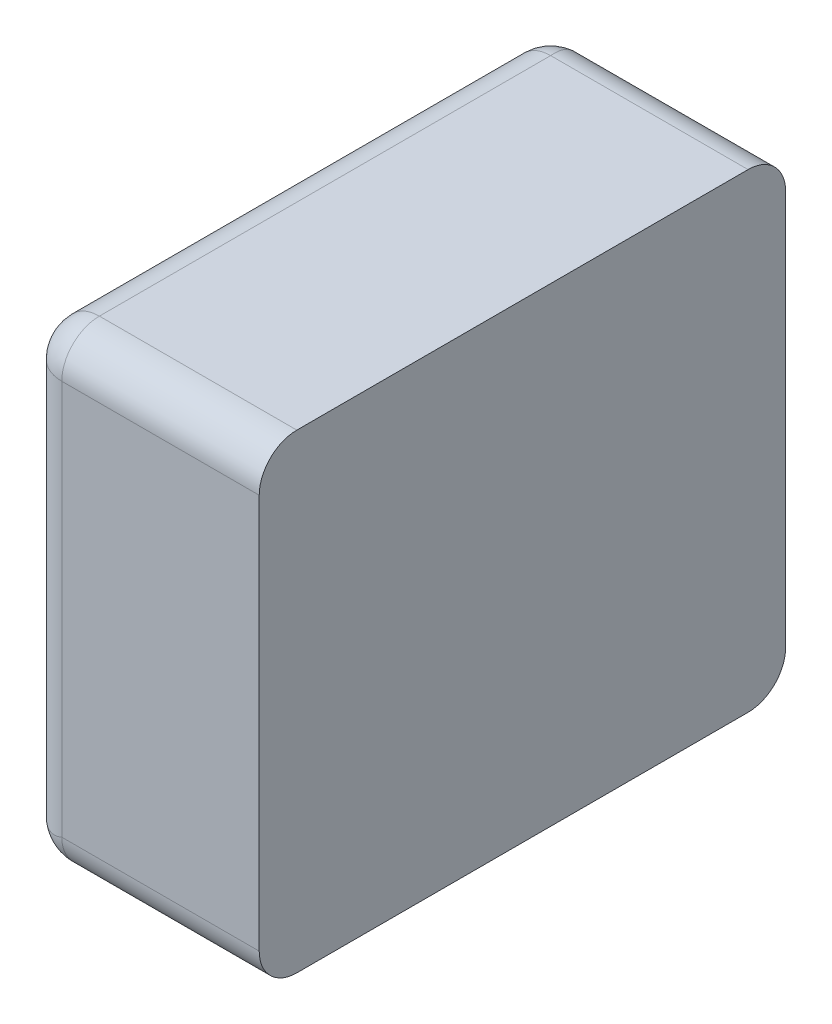
ISO-10303-21;
HEADER;
FILE_DESCRIPTION(('STEP AP214'),'2;1');
FILE_NAME('part.step','',(''),(''),'','','');
FILE_SCHEMA(('AUTOMOTIVE_DESIGN { 1 0 10303 214 1 1 1 1 }'));
ENDSEC;
DATA;
#1=APPLICATION_CONTEXT('core data for automotive mechanical design processes');
#2=APPLICATION_PROTOCOL_DEFINITION('international standard','automotive_design',2000,#1);
#3=PRODUCT_CONTEXT('',#1,'mechanical');
#4=PRODUCT('Part','Part','',(#3));
#5=PRODUCT_RELATED_PRODUCT_CATEGORY('part','',(#4));
#6=PRODUCT_DEFINITION_FORMATION('','',#4);
#7=PRODUCT_DEFINITION_CONTEXT('part definition',#1,'design');
#8=PRODUCT_DEFINITION('design','',#6,#7);
#9=PRODUCT_DEFINITION_SHAPE('','',#8);
#10=(LENGTH_UNIT() NAMED_UNIT(*) SI_UNIT(.MILLI.,.METRE.));
#11=(NAMED_UNIT(*) PLANE_ANGLE_UNIT() SI_UNIT($,.RADIAN.));
#12=(NAMED_UNIT(*) SI_UNIT($,.STERADIAN.) SOLID_ANGLE_UNIT());
#13=UNCERTAINTY_MEASURE_WITH_UNIT(LENGTH_MEASURE(1.E-05),#10,'distance_accuracy_value','');
#14=(GEOMETRIC_REPRESENTATION_CONTEXT(3) GLOBAL_UNCERTAINTY_ASSIGNED_CONTEXT((#13)) GLOBAL_UNIT_ASSIGNED_CONTEXT((#10,
#11,#12)) REPRESENTATION_CONTEXT('',''));
#15=CARTESIAN_POINT('',(0.,0.,0.));
#16=DIRECTION('',(0.,0.,1.));
#17=DIRECTION('',(1.,0.,0.));
#18=AXIS2_PLACEMENT_3D('',#15,#16,#17);
#19=CARTESIAN_POINT('',(-0.46,-0.21,0.04));
#20=DIRECTION('',(0.408248290463863,0.408248290463863,-0.816496580927726));
#21=DIRECTION('',(-0.577350269189626,-0.577350269189626,-0.577350269189626));
#22=AXIS2_PLACEMENT_3D('',#19,#20,#21);
#23=SPHERICAL_SURFACE('',#22,0.04);
#24=CARTESIAN_POINT('',(-0.46,-0.21,0.04));
#25=DIRECTION('',(0.,0.,-1.));
#26=DIRECTION('',(-1.,0.,0.));
#27=AXIS2_PLACEMENT_3D('',#24,#25,#26);
#28=CIRCLE('',#27,0.04);
#29=CARTESIAN_POINT('',(-0.46,-0.25,0.04));
#30=VERTEX_POINT('',#29);
#31=CARTESIAN_POINT('',(-0.5,-0.21,0.04));
#32=VERTEX_POINT('',#31);
#33=EDGE_CURVE('E11',#30,#32,#28,.T.);
#34=ORIENTED_EDGE('',*,*,#33,.T.);
#35=CARTESIAN_POINT('',(-0.46,-0.21,0.04));
#36=DIRECTION('',(0.,-1.,0.));
#37=DIRECTION('',(0.,0.,-1.));
#38=AXIS2_PLACEMENT_3D('',#35,#36,#37);
#39=CIRCLE('',#38,0.04);
#40=CARTESIAN_POINT('',(-0.46,-0.21,0.));
#41=VERTEX_POINT('',#40);
#42=EDGE_CURVE('E25',#32,#41,#39,.T.);
#43=ORIENTED_EDGE('',*,*,#42,.T.);
#44=CARTESIAN_POINT('',(-0.46,-0.21,0.));
#45=CARTESIAN_POINT('',(-0.460127557385056,-0.210278560754346,-1.18072138294032E-09));
#46=CARTESIAN_POINT('',(-0.460252147979106,-0.210558476265733,3.51993958575014E-06));
#47=CARTESIAN_POINT('',(-0.460495869427172,-0.211121737223217,1.76243940577201E-05));
#48=CARTESIAN_POINT('',(-0.460614978217461,-0.211405091561275,2.82339832723442E-05));
#49=CARTESIAN_POINT('',(-0.460847694547059,-0.211974934925471,5.6585914872202E-05));
#50=CARTESIAN_POINT('',(-0.460961279831825,-0.212261431714088,7.43548005994813E-05));
#51=CARTESIAN_POINT('',(-0.461182918810225,-0.2128372634657,0.000117088509181837));
#52=CARTESIAN_POINT('',(-0.461290950148552,-0.213126605044557,0.000142080083021138));
#53=CARTESIAN_POINT('',(-0.461501458734764,-0.213707827313347,0.00019931719054796));
#54=CARTESIAN_POINT('',(-0.461603913603208,-0.213999713457951,0.000231589611122887));
#55=CARTESIAN_POINT('',(-0.461803255191422,-0.214585722737492,0.000303440197509092));
#56=CARTESIAN_POINT('',(-0.461900119585062,-0.214879850156528,0.000343045311385643));
#57=CARTESIAN_POINT('',(-0.462088275552899,-0.215470042193562,0.000429608185776674));
#58=CARTESIAN_POINT('',(-0.462179544933358,-0.215766109942693,0.000476592887279755));
#59=CARTESIAN_POINT('',(-0.462356511105422,-0.216359866083455,0.000577951876045367));
#60=CARTESIAN_POINT('',(-0.462442185895687,-0.216657556406001,0.000632353011704264));
#61=CARTESIAN_POINT('',(-0.462691323865077,-0.217554249833819,0.00080701684119811));
#62=CARTESIAN_POINT('',(-0.462845874981088,-0.218153648342018,0.000938267444546423));
#63=CARTESIAN_POINT('',(-0.463132999169867,-0.219355247629956,0.00123055854383293));
#64=CARTESIAN_POINT('',(-0.463265404318734,-0.219957437108347,0.00139180864660248));
#65=CARTESIAN_POINT('',(-0.463508574015279,-0.221162228110556,0.00174420122467979));
#66=CARTESIAN_POINT('',(-0.463619178639514,-0.221764802341561,0.00193554733844657));
#67=CARTESIAN_POINT('',(-0.463819193285901,-0.22296791621749,0.00234811839129835));
#68=CARTESIAN_POINT('',(-0.46390845289006,-0.223568413630763,0.0025695390760552));
#69=CARTESIAN_POINT('',(-0.464066354376574,-0.224764966470295,0.00304214168525152));
#70=CARTESIAN_POINT('',(-0.464134856746394,-0.225360966678358,0.00329350983136255));
#71=CARTESIAN_POINT('',(-0.464251940785221,-0.22654614471619,0.00382578019481727));
#72=CARTESIAN_POINT('',(-0.464300394897465,-0.227135256366021,0.00410685765918635));
#73=CARTESIAN_POINT('',(-0.464378196984959,-0.228304320731066,0.00469820970399706));
#74=CARTESIAN_POINT('',(-0.46440743011501,-0.228884198547395,0.00500864733151548));
#75=CARTESIAN_POINT('',(-0.464447716751283,-0.230032511248382,0.00565827192058936));
#76=CARTESIAN_POINT('',(-0.464458668570609,-0.230600864869804,0.00599760872761896));
#77=CARTESIAN_POINT('',(-0.464463425502259,-0.231723908356188,0.00670447287731431));
#78=CARTESIAN_POINT('',(-0.464457142234807,-0.232278513023084,0.00707213609172891));
#79=CARTESIAN_POINT('',(-0.4644285620246,-0.233371910678868,0.00783498345682941));
#80=CARTESIAN_POINT('',(-0.464406189870943,-0.233910616989062,0.00823028896307658));
#81=CARTESIAN_POINT('',(-0.464346658254607,-0.234970152446474,0.00904764125945902));
#82=CARTESIAN_POINT('',(-0.464309436340763,-0.235490895871217,0.00946979457457917));
#83=CARTESIAN_POINT('',(-0.464221517607221,-0.236512531597073,0.0103399540326488));
#84=CARTESIAN_POINT('',(-0.464170770435167,-0.237013341512198,0.010788051779879));
#85=CARTESIAN_POINT('',(-0.46405719186342,-0.237993236431504,0.0117091046013599));
#86=CARTESIAN_POINT('',(-0.463994321319257,-0.238472244674781,0.0121821364878388));
#87=CARTESIAN_POINT('',(-0.463857956766166,-0.239406770787941,0.013151957304817));
#88=CARTESIAN_POINT('',(-0.463784433723583,-0.239862219687463,0.013648808595971));
#89=CARTESIAN_POINT('',(-0.463628286445982,-0.240747977592035,0.0146650659177713));
#90=CARTESIAN_POINT('',(-0.46354564201038,-0.241178227431671,0.0151845204015858));
#91=CARTESIAN_POINT('',(-0.463372826812942,-0.242012060678785,0.0162446830324919));
#92=CARTESIAN_POINT('',(-0.463282643251913,-0.242415596564543,0.0167854264635976));
#93=CARTESIAN_POINT('',(-0.463096368054564,-0.243194604782275,0.0178867708690628));
#94=CARTESIAN_POINT('',(-0.463000269462519,-0.243570042877811,0.0184473948804289));
#95=CARTESIAN_POINT('',(-0.462803816384422,-0.244291593601069,0.0195870134748399));
#96=CARTESIAN_POINT('',(-0.462703459130377,-0.244637686703484,0.0201660199423669));
#97=CARTESIAN_POINT('',(-0.46250016518995,-0.245299425855903,0.0213408302671167));
#98=CARTESIAN_POINT('',(-0.462397228198719,-0.245615068285972,0.0219366361105733));
#99=CARTESIAN_POINT('',(-0.462190465730978,-0.24621492926737,0.0231433908657014));
#100=CARTESIAN_POINT('',(-0.462086640648683,-0.246499161053504,0.0237543332657589));
#101=CARTESIAN_POINT('',(-0.461879797543165,-0.247035372388784,0.0249896311582642));
#102=CARTESIAN_POINT('',(-0.46177677883926,-0.247287382721173,0.02561397317289));
#103=CARTESIAN_POINT('',(-0.46157323870074,-0.247758474251228,0.0268742705254565));
#104=CARTESIAN_POINT('',(-0.46147271375646,-0.247977604210201,0.0275102070660422));
#105=CARTESIAN_POINT('',(-0.461275836098283,-0.248382411747495,0.0287918301830908));
#106=CARTESIAN_POINT('',(-0.461179475341301,-0.248568156224819,0.029437494386606));
#107=CARTESIAN_POINT('',(-0.460992575894087,-0.248905824846854,0.0307366524585404));
#108=CARTESIAN_POINT('',(-0.46090202300229,-0.249057833913879,0.0313901222006782));
#109=CARTESIAN_POINT('',(-0.4607283543202,-0.249327819170727,0.0327029213142236));
#110=CARTESIAN_POINT('',(-0.460645216653365,-0.249445897918684,0.0333622266837099));
#111=CARTESIAN_POINT('',(-0.460487948826669,-0.249647967602046,0.0346846825640378));
#112=CARTESIAN_POINT('',(-0.460413787737315,-0.249732078063409,0.0353478111151387));
#113=CARTESIAN_POINT('',(-0.460275990401151,-0.249866304694446,0.0366758691427694));
#114=CARTESIAN_POINT('',(-0.460212312956498,-0.24991655645203,0.0373407806009987));
#115=CARTESIAN_POINT('',(-0.460096934649245,-0.249983337054039,0.0386703111001373));
#116=CARTESIAN_POINT('',(-0.460045181312705,-0.250000016251174,0.0393349180578663));
#117=CARTESIAN_POINT('',(-0.46,-0.25,0.04));
#118=B_SPLINE_CURVE_WITH_KNOTS('',3,(#44,#45,#46,#47,#48,#49,#50,#51,#52,#53,#54,#55,#56,#57,
#58,#59,#60,#61,#62,#63,#64,#65,#66,#67,#68,#69,#70,#71,#72,#73,#74,#75,#76,#77,#78,#79,#80,#81,
#82,#83,#84,#85,#86,#87,#88,#89,#90,#91,#92,#93,#94,#95,#96,#97,#98,#99,#100,#101,#102,#103,
#104,#105,#106,#107,#108,#109,#110,#111,#112,#113,#114,#115,#116,#117),.UNSPECIFIED.,.F.,.F.,(4,
2,2,2,2,2,2,2,2,2,2,2,2,2,2,2,2,2,2,2,2,2,2,2,2,2,2,2,2,2,2,2,2,2,2,2,4),(0.,
0.000919089022198575,0.00184160128014346,0.00276756572820716,0.0036970046531216,
0.00462993370669373,0.00556636195101822,0.00650629191553111,0.00744971966525181,
0.0093468156756545,0.0112577016204073,0.0131821224064945,0.0151197292985631,0.0170700841596432,
0.0190326640796589,0.0210068663346625,0.0229920136260436,0.0249873595550524,0.0269920942936929,
0.0290053504183038,0.0310262088768823,0.0330537050654175,0.0350868349921645,0.0371245615119336,
0.0391658206151052,0.0412095277582366,0.0432545842248347,0.0452998835061398,0.0473443176926332,
0.0493867838674516,0.0514261904929764,0.0534614637815629,0.0554915540406866,0.0575154419816866,
0.0595321449797765,0.0615407232710351,0.063540286069666),.UNSPECIFIED.);
#119=EDGE_CURVE('E108',#41,#30,#118,.T.);
#120=ORIENTED_EDGE('',*,*,#119,.T.);
#121=EDGE_LOOP('',(#34,#43,#120));
#122=FACE_BOUND('',#121,.T.);
#123=ADVANCED_FACE('F17',(#122),#23,.T.);
#124=CARTESIAN_POINT('',(-0.46,0.21,0.04));
#125=DIRECTION('',(0.408248290463863,-0.408248290463862,-0.816496580927727));
#126=DIRECTION('',(-0.577350269189628,0.577350269189625,-0.577350269189625));
#127=AXIS2_PLACEMENT_3D('',#124,#125,#126);
#128=SPHERICAL_SURFACE('',#127,0.04);
#129=CARTESIAN_POINT('',(-0.46,0.21,0.04));
#130=DIRECTION('',(0.,0.,-1.));
#131=DIRECTION('',(0.,1.,0.));
#132=AXIS2_PLACEMENT_3D('',#129,#130,#131);
#133=CIRCLE('',#132,0.04);
#134=CARTESIAN_POINT('',(-0.5,0.21,0.04));
#135=VERTEX_POINT('',#134);
#136=CARTESIAN_POINT('',(-0.46,0.25,0.04));
#137=VERTEX_POINT('',#136);
#138=EDGE_CURVE('E295',#135,#137,#133,.T.);
#139=ORIENTED_EDGE('',*,*,#138,.T.);
#140=CARTESIAN_POINT('',(-0.46,0.25,0.04));
#141=CARTESIAN_POINT('',(-0.460045181312705,0.250000016251174,0.0393349180578663));
#142=CARTESIAN_POINT('',(-0.460096934649245,0.249983337054039,0.0386703111001374));
#143=CARTESIAN_POINT('',(-0.460212312956498,0.24991655645203,0.0373407806009987));
#144=CARTESIAN_POINT('',(-0.460275990401151,0.249866304694446,0.0366758691427694));
#145=CARTESIAN_POINT('',(-0.460413787737315,0.249732078063409,0.0353478111151388));
#146=CARTESIAN_POINT('',(-0.460487948826669,0.249647967602046,0.0346846825640378));
#147=CARTESIAN_POINT('',(-0.460645216653365,0.249445897918684,0.03336222668371));
#148=CARTESIAN_POINT('',(-0.4607283543202,0.249327819170727,0.0327029213142236));
#149=CARTESIAN_POINT('',(-0.46090202300229,0.249057833913879,0.0313901222006782));
#150=CARTESIAN_POINT('',(-0.460992575894087,0.248905824846854,0.0307366524585404));
#151=CARTESIAN_POINT('',(-0.461179475341301,0.248568156224819,0.029437494386606));
#152=CARTESIAN_POINT('',(-0.461275836098283,0.248382411747495,0.0287918301830908));
#153=CARTESIAN_POINT('',(-0.46147271375646,0.247977604210201,0.0275102070660422));
#154=CARTESIAN_POINT('',(-0.46157323870074,0.247758474251228,0.0268742705254564));
#155=CARTESIAN_POINT('',(-0.46177677883926,0.247287382721173,0.0256139731728899));
#156=CARTESIAN_POINT('',(-0.461879797543165,0.247035372388784,0.0249896311582642));
#157=CARTESIAN_POINT('',(-0.462086640648683,0.246499161053504,0.0237543332657589));
#158=CARTESIAN_POINT('',(-0.462190465730978,0.24621492926737,0.0231433908657014));
#159=CARTESIAN_POINT('',(-0.462397228198719,0.245615068285972,0.0219366361105733));
#160=CARTESIAN_POINT('',(-0.46250016518995,0.245299425855903,0.0213408302671167));
#161=CARTESIAN_POINT('',(-0.462703459130378,0.244637686703484,0.020166019942367));
#162=CARTESIAN_POINT('',(-0.462803816384422,0.244291593601069,0.0195870134748399));
#163=CARTESIAN_POINT('',(-0.463000269462519,0.243570042877811,0.0184473948804289));
#164=CARTESIAN_POINT('',(-0.463096368054564,0.243194604782275,0.0178867708690628));
#165=CARTESIAN_POINT('',(-0.463282643251913,0.242415596564543,0.0167854264635976));
#166=CARTESIAN_POINT('',(-0.463372826812942,0.242012060678785,0.0162446830324919));
#167=CARTESIAN_POINT('',(-0.46354564201038,0.241178227431671,0.0151845204015858));
#168=CARTESIAN_POINT('',(-0.463628286445982,0.240747977592035,0.0146650659177713));
#169=CARTESIAN_POINT('',(-0.463784433723584,0.239862219687463,0.013648808595971));
#170=CARTESIAN_POINT('',(-0.463857956766166,0.239406770787941,0.013151957304817));
#171=CARTESIAN_POINT('',(-0.463994321319257,0.238472244674781,0.0121821364878388));
#172=CARTESIAN_POINT('',(-0.46405719186342,0.237993236431504,0.0117091046013598));
#173=CARTESIAN_POINT('',(-0.464170770435167,0.237013341512198,0.010788051779879));
#174=CARTESIAN_POINT('',(-0.464221517607221,0.236512531597073,0.0103399540326488));
#175=CARTESIAN_POINT('',(-0.464309436340763,0.235490895871217,0.00946979457457914));
#176=CARTESIAN_POINT('',(-0.464346658254607,0.234970152446474,0.009047641259459));
#177=CARTESIAN_POINT('',(-0.464406189870943,0.233910616989061,0.00823028896307656));
#178=CARTESIAN_POINT('',(-0.4644285620246,0.233371910678868,0.0078349834568294));
#179=CARTESIAN_POINT('',(-0.464457142234807,0.232278513023084,0.0070721360917289));
#180=CARTESIAN_POINT('',(-0.464463425502259,0.231723908356188,0.00670447287731431));
#181=CARTESIAN_POINT('',(-0.464458668570609,0.230600864869804,0.00599760872761896));
#182=CARTESIAN_POINT('',(-0.464447716751283,0.230032511248382,0.00565827192058937));
#183=CARTESIAN_POINT('',(-0.46440743011501,0.228884198547395,0.0050086473315155));
#184=CARTESIAN_POINT('',(-0.464378196984959,0.228304320731066,0.00469820970399707));
#185=CARTESIAN_POINT('',(-0.464300394897465,0.227135256366021,0.00410685765918635));
#186=CARTESIAN_POINT('',(-0.464251940785221,0.22654614471619,0.00382578019481727));
#187=CARTESIAN_POINT('',(-0.464134856746394,0.225360966678358,0.00329350983136255));
#188=CARTESIAN_POINT('',(-0.464066354376574,0.224764966470295,0.00304214168525152));
#189=CARTESIAN_POINT('',(-0.46390845289006,0.223568413630763,0.0025695390760552));
#190=CARTESIAN_POINT('',(-0.463819193285901,0.22296791621749,0.00234811839129834));
#191=CARTESIAN_POINT('',(-0.463619178639514,0.221764802341561,0.00193554733844656));
#192=CARTESIAN_POINT('',(-0.463508574015279,0.221162228110556,0.00174420122467977));
#193=CARTESIAN_POINT('',(-0.463265404318734,0.219957437108347,0.00139180864660246));
#194=CARTESIAN_POINT('',(-0.463132999169867,0.219355247629956,0.00123055854383292));
#195=CARTESIAN_POINT('',(-0.462845874981088,0.218153648342018,0.000938267444546416));
#196=CARTESIAN_POINT('',(-0.462691323865077,0.217554249833819,0.000807016841198092));
#197=CARTESIAN_POINT('',(-0.462442185895688,0.216657556406001,0.000632353011704253));
#198=CARTESIAN_POINT('',(-0.462356511105422,0.216359866083455,0.000577951876045363));
#199=CARTESIAN_POINT('',(-0.462179544933358,0.215766109942693,0.00047659288727976));
#200=CARTESIAN_POINT('',(-0.462088275552899,0.215470042193562,0.000429608185776681));
#201=CARTESIAN_POINT('',(-0.461900119585062,0.214879850156529,0.000343045311385648));
#202=CARTESIAN_POINT('',(-0.461803255191423,0.214585722737492,0.000303440197509093));
#203=CARTESIAN_POINT('',(-0.461603913603209,0.213999713457951,0.000231589611122885));
#204=CARTESIAN_POINT('',(-0.461501458734764,0.213707827313347,0.00019931719054796));
#205=CARTESIAN_POINT('',(-0.461290950148552,0.213126605044557,0.000142080083021138));
#206=CARTESIAN_POINT('',(-0.461182918810225,0.2128372634657,0.000117088509181835));
#207=CARTESIAN_POINT('',(-0.460961279831825,0.212261431714088,7.43548005994835E-05));
#208=CARTESIAN_POINT('',(-0.460847694547059,0.211974934925471,5.65859148722095E-05));
#209=CARTESIAN_POINT('',(-0.460614978217461,0.211405091561275,2.82339832723494E-05));
#210=CARTESIAN_POINT('',(-0.460495869427172,0.211121737223217,1.76243940577182E-05));
#211=CARTESIAN_POINT('',(-0.460252147979106,0.210558476265733,3.5199395857389E-06));
#212=CARTESIAN_POINT('',(-0.460127557385056,0.210278560754346,-1.18072139678394E-09));
#213=CARTESIAN_POINT('',(-0.46,0.21,0.));
#214=B_SPLINE_CURVE_WITH_KNOTS('',3,(#140,#141,#142,#143,#144,#145,#146,#147,#148,#149,#150,
#151,#152,#153,#154,#155,#156,#157,#158,#159,#160,#161,#162,#163,#164,#165,#166,#167,#168,#169,
#170,#171,#172,#173,#174,#175,#176,#177,#178,#179,#180,#181,#182,#183,#184,#185,#186,#187,#188,
#189,#190,#191,#192,#193,#194,#195,#196,#197,#198,#199,#200,#201,#202,#203,#204,#205,#206,#207,
#208,#209,#210,#211,#212,#213),.UNSPECIFIED.,.F.,.F.,(4,2,2,2,2,2,2,2,2,2,2,2,2,2,2,2,2,2,2,2,2,
2,2,2,2,2,2,2,2,2,2,2,2,2,2,2,4),(0.,0.00199956279863086,0.0040081410898894,0.00602484408797931,
0.00804873202897934,0.0100788222881031,0.0121140955766896,0.0141535022022144,0.0161959683770328,
0.0182404025635261,0.0202857018448312,0.0223307583114294,0.0243744654545608,0.0264157245577324,
0.0284534510775015,0.0304865810042485,0.0325140771927837,0.0345349356513622,0.0365481917759731,
0.0385529265146136,0.0405482724436223,0.0425334197350035,0.044507621990007,0.0464702019100227,
0.0484205567711029,0.0503581636631715,0.0522825844492588,0.0541934703940115,0.0560905664044142,
0.0570339941541349,0.0579739241186477,0.0589103523629722,0.0598432814165443,0.0607727203414588,
0.0616986847895225,0.0626211970474674,0.063540286069666),.UNSPECIFIED.);
#215=CARTESIAN_POINT('',(-0.46,0.21,0.));
#216=VERTEX_POINT('',#215);
#217=EDGE_CURVE('E264',#137,#216,#214,.T.);
#218=ORIENTED_EDGE('',*,*,#217,.T.);
#219=CARTESIAN_POINT('',(-0.46,0.21,0.04));
#220=DIRECTION('',(0.,1.,0.));
#221=DIRECTION('',(-1.,0.,0.));
#222=AXIS2_PLACEMENT_3D('',#219,#220,#221);
#223=CIRCLE('',#222,0.0400000000000001);
#224=EDGE_CURVE('E259',#216,#135,#223,.T.);
#225=ORIENTED_EDGE('',*,*,#224,.T.);
#226=EDGE_LOOP('',(#139,#218,#225));
#227=FACE_BOUND('',#226,.T.);
#228=ADVANCED_FACE('F278',(#227),#128,.T.);
#229=CARTESIAN_POINT('',(-0.3125,0.21,0.04));
#230=DIRECTION('',(-1.,0.,0.));
#231=DIRECTION('',(0.,0.707106781186548,-0.707106781186547));
#232=AXIS2_PLACEMENT_3D('',#229,#230,#231);
#233=CYLINDRICAL_SURFACE('',#232,0.04);
#234=CARTESIAN_POINT('',(-0.25,0.21,0.04));
#235=DIRECTION('',(-1.,0.,0.));
#236=DIRECTION('',(0.,0.707106781186548,-0.707106781186547));
#237=AXIS2_PLACEMENT_3D('',#234,#235,#236);
#238=CIRCLE('',#237,0.04);
#239=CARTESIAN_POINT('',(-0.25,0.25,0.04));
#240=VERTEX_POINT('',#239);
#241=CARTESIAN_POINT('',(-0.25,0.21,0.));
#242=VERTEX_POINT('',#241);
#243=EDGE_CURVE('E257',#240,#242,#238,.T.);
#244=ORIENTED_EDGE('',*,*,#243,.T.);
#245=DIRECTION('',(-1.,0.,0.));
#246=VECTOR('',#245,1.);
#247=CARTESIAN_POINT('',(-0.3125,0.21,0.));
#248=LINE('',#247,#246);
#249=EDGE_CURVE('E118',#242,#216,#248,.T.);
#250=ORIENTED_EDGE('',*,*,#249,.T.);
#251=ORIENTED_EDGE('',*,*,#217,.F.);
#252=DIRECTION('',(1.,0.,0.));
#253=VECTOR('',#252,1.);
#254=CARTESIAN_POINT('',(-0.3125,0.25,0.04));
#255=LINE('',#254,#253);
#256=EDGE_CURVE('E249',#137,#240,#255,.T.);
#257=ORIENTED_EDGE('',*,*,#256,.T.);
#258=EDGE_LOOP('',(#244,#250,#251,#257));
#259=FACE_BOUND('',#258,.T.);
#260=ADVANCED_FACE('F270',(#259),#233,.T.);
#261=CARTESIAN_POINT('',(-0.46,0.125,0.04));
#262=DIRECTION('',(0.,-1.,0.));
#263=DIRECTION('',(-0.707106781186549,0.,-0.707106781186546));
#264=AXIS2_PLACEMENT_3D('',#261,#262,#263);
#265=CYLINDRICAL_SURFACE('',#264,0.04);
#266=ORIENTED_EDGE('',*,*,#42,.F.);
#267=DIRECTION('',(0.,1.,0.));
#268=VECTOR('',#267,1.);
#269=CARTESIAN_POINT('',(-0.5,0.125,0.04));
#270=LINE('',#269,#268);
#271=EDGE_CURVE('E246',#32,#135,#270,.T.);
#272=ORIENTED_EDGE('',*,*,#271,.T.);
#273=ORIENTED_EDGE('',*,*,#224,.F.);
#274=DIRECTION('',(0.,-1.,0.));
#275=VECTOR('',#274,1.);
#276=CARTESIAN_POINT('',(-0.46,0.125,0.));
#277=LINE('',#276,#275);
#278=EDGE_CURVE('E244',#216,#41,#277,.T.);
#279=ORIENTED_EDGE('',*,*,#278,.T.);
#280=EDGE_LOOP('',(#266,#272,#273,#279));
#281=FACE_BOUND('',#280,.T.);
#282=ADVANCED_FACE('F229',(#281),#265,.T.);
#283=CARTESIAN_POINT('',(-0.46,-0.21,0.52));
#284=DIRECTION('',(-0.408248290463864,-0.408248290463862,-0.816496580927726));
#285=DIRECTION('',(-0.577350269189627,-0.577350269189625,0.577350269189626));
#286=AXIS2_PLACEMENT_3D('',#283,#284,#285);
#287=SPHERICAL_SURFACE('',#286,0.04);
#288=CARTESIAN_POINT('',(-0.46,-0.21,0.56));
#289=CARTESIAN_POINT('',(-0.460278560754346,-0.210127557385056,0.560000001180721));
#290=CARTESIAN_POINT('',(-0.460558476265733,-0.210252147979106,0.559996480060414));
#291=CARTESIAN_POINT('',(-0.461121737223217,-0.210495869427172,0.559982375605942));
#292=CARTESIAN_POINT('',(-0.461405091561275,-0.210614978217461,0.559971766016728));
#293=CARTESIAN_POINT('',(-0.461974934925471,-0.210847694547059,0.559943414085128));
#294=CARTESIAN_POINT('',(-0.462261431714088,-0.210961279831825,0.559925645199401));
#295=CARTESIAN_POINT('',(-0.4628372634657,-0.211182918810225,0.559882911490818));
#296=CARTESIAN_POINT('',(-0.463126605044557,-0.211290950148552,0.559857919916979));
#297=CARTESIAN_POINT('',(-0.463707827313347,-0.211501458734764,0.559800682809452));
#298=CARTESIAN_POINT('',(-0.463999713457951,-0.211603913603208,0.559768410388877));
#299=CARTESIAN_POINT('',(-0.464585722737492,-0.211803255191422,0.559696559802491));
#300=CARTESIAN_POINT('',(-0.464879850156529,-0.211900119585062,0.559656954688614));
#301=CARTESIAN_POINT('',(-0.465470042193562,-0.212088275552899,0.559570391814223));
#302=CARTESIAN_POINT('',(-0.465766109942693,-0.212179544933358,0.55952340711272));
#303=CARTESIAN_POINT('',(-0.466359866083455,-0.212356511105421,0.559422048123955));
#304=CARTESIAN_POINT('',(-0.466657556406001,-0.212442185895687,0.559367646988296));
#305=CARTESIAN_POINT('',(-0.467554249833819,-0.212691323865077,0.559192983158802));
#306=CARTESIAN_POINT('',(-0.468153648342018,-0.212845874981088,0.559061732555454));
#307=CARTESIAN_POINT('',(-0.469355247629956,-0.213132999169867,0.558769441456167));
#308=CARTESIAN_POINT('',(-0.469957437108347,-0.213265404318734,0.558608191353398));
#309=CARTESIAN_POINT('',(-0.471162228110557,-0.213508574015279,0.55825579877532));
#310=CARTESIAN_POINT('',(-0.471764802341561,-0.213619178639514,0.558064452661553));
#311=CARTESIAN_POINT('',(-0.47296791621749,-0.213819193285901,0.557651881608702));
#312=CARTESIAN_POINT('',(-0.473568413630763,-0.21390845289006,0.557430460923945));
#313=CARTESIAN_POINT('',(-0.474764966470295,-0.214066354376574,0.556957858314749));
#314=CARTESIAN_POINT('',(-0.475360966678358,-0.214134856746394,0.556706490168637));
#315=CARTESIAN_POINT('',(-0.47654614471619,-0.21425194078522,0.556174219805183));
#316=CARTESIAN_POINT('',(-0.477135256366021,-0.214300394897465,0.555893142340814));
#317=CARTESIAN_POINT('',(-0.478304320731066,-0.214378196984959,0.555301790296003));
#318=CARTESIAN_POINT('',(-0.478884198547395,-0.21440743011501,0.554991352668485));
#319=CARTESIAN_POINT('',(-0.480032511248382,-0.214447716751283,0.554341728079411));
#320=CARTESIAN_POINT('',(-0.480600864869804,-0.214458668570609,0.554002391272381));
#321=CARTESIAN_POINT('',(-0.481723908356188,-0.214463425502259,0.553295527122686));
#322=CARTESIAN_POINT('',(-0.482278513023084,-0.214457142234807,0.552927863908271));
#323=CARTESIAN_POINT('',(-0.483371910678868,-0.2144285620246,0.552165016543171));
#324=CARTESIAN_POINT('',(-0.483910616989062,-0.214406189870943,0.551769711036924));
#325=CARTESIAN_POINT('',(-0.484970152446475,-0.214346658254607,0.550952358740541));
#326=CARTESIAN_POINT('',(-0.485490895871217,-0.214309436340763,0.550530205425421));
#327=CARTESIAN_POINT('',(-0.486512531597073,-0.214221517607221,0.549660045967351));
#328=CARTESIAN_POINT('',(-0.487013341512198,-0.214170770435167,0.549211948220121));
#329=CARTESIAN_POINT('',(-0.487993236431504,-0.21405719186342,0.54829089539864));
#330=CARTESIAN_POINT('',(-0.488472244674781,-0.213994321319257,0.547817863512161));
#331=CARTESIAN_POINT('',(-0.489406770787941,-0.213857956766166,0.546848042695183));
#332=CARTESIAN_POINT('',(-0.489862219687463,-0.213784433723583,0.546351191404029));
#333=CARTESIAN_POINT('',(-0.490747977592035,-0.213628286445982,0.545334934082229));
#334=CARTESIAN_POINT('',(-0.491178227431671,-0.21354564201038,0.544815479598414));
#335=CARTESIAN_POINT('',(-0.492012060678785,-0.213372826812942,0.543755316967508));
#336=CARTESIAN_POINT('',(-0.492415596564543,-0.213282643251913,0.543214573536402));
#337=CARTESIAN_POINT('',(-0.493194604782275,-0.213096368054564,0.542113229130937));
#338=CARTESIAN_POINT('',(-0.493570042877811,-0.213000269462519,0.541552605119571));
#339=CARTESIAN_POINT('',(-0.494291593601069,-0.212803816384422,0.54041298652516));
#340=CARTESIAN_POINT('',(-0.494637686703484,-0.212703459130377,0.539833980057633));
#341=CARTESIAN_POINT('',(-0.495299425855903,-0.21250016518995,0.538659169732883));
#342=CARTESIAN_POINT('',(-0.495615068285972,-0.212397228198719,0.538063363889427));
#343=CARTESIAN_POINT('',(-0.49621492926737,-0.212190465730978,0.536856609134299));
#344=CARTESIAN_POINT('',(-0.496499161053504,-0.212086640648683,0.536245666734241));
#345=CARTESIAN_POINT('',(-0.497035372388784,-0.211879797543165,0.535010368841736));
#346=CARTESIAN_POINT('',(-0.497287382721173,-0.21177677883926,0.53438602682711));
#347=CARTESIAN_POINT('',(-0.497758474251228,-0.21157323870074,0.533125729474544));
#348=CARTESIAN_POINT('',(-0.497977604210201,-0.21147271375646,0.532489792933958));
#349=CARTESIAN_POINT('',(-0.498382411747495,-0.211275836098283,0.531208169816909));
#350=CARTESIAN_POINT('',(-0.498568156224819,-0.211179475341301,0.530562505613394));
#351=CARTESIAN_POINT('',(-0.498905824846854,-0.210992575894087,0.52926334754146));
#352=CARTESIAN_POINT('',(-0.499057833913879,-0.21090202300229,0.528609877799322));
#353=CARTESIAN_POINT('',(-0.499327819170727,-0.2107283543202,0.527297078685776));
#354=CARTESIAN_POINT('',(-0.499445897918684,-0.210645216653365,0.52663777331629));
#355=CARTESIAN_POINT('',(-0.499647967602046,-0.210487948826669,0.525315317435962));
#356=CARTESIAN_POINT('',(-0.499732078063409,-0.210413787737315,0.524652188884861));
#357=CARTESIAN_POINT('',(-0.499866304694446,-0.210275990401151,0.523324130857231));
#358=CARTESIAN_POINT('',(-0.49991655645203,-0.210212312956498,0.522659219399001));
#359=CARTESIAN_POINT('',(-0.499983337054039,-0.210096934649245,0.521329688899863));
#360=CARTESIAN_POINT('',(-0.500000016251174,-0.210045181312705,0.520665081942134));
#361=CARTESIAN_POINT('',(-0.5,-0.21,0.52));
#362=B_SPLINE_CURVE_WITH_KNOTS('',3,(#288,#289,#290,#291,#292,#293,#294,#295,#296,#297,#298,
#299,#300,#301,#302,#303,#304,#305,#306,#307,#308,#309,#310,#311,#312,#313,#314,#315,#316,#317,
#318,#319,#320,#321,#322,#323,#324,#325,#326,#327,#328,#329,#330,#331,#332,#333,#334,#335,#336,
#337,#338,#339,#340,#341,#342,#343,#344,#345,#346,#347,#348,#349,#350,#351,#352,#353,#354,#355,
#356,#357,#358,#359,#360,#361),.UNSPECIFIED.,.F.,.F.,(4,2,2,2,2,2,2,2,2,2,2,2,2,2,2,2,2,2,2,2,2,
2,2,2,2,2,2,2,2,2,2,2,2,2,2,2,4),(0.,0.00091908902219855,0.00184160128014348,
0.00276756572820715,0.0036970046531216,0.00462993370669375,0.00556636195101822,
0.0065062919155311,0.0074497196652518,0.00934681567565449,0.0112577016204073,0.0131821224064945,
0.0151197292985631,0.0170700841596432,0.0190326640796589,0.0210068663346624,0.0229920136260436,
0.0249873595550523,0.0269920942936928,0.0290053504183037,0.0310262088768822,0.0330537050654175,
0.0350868349921644,0.0371245615119336,0.0391658206151051,0.0412095277582364,0.0432545842248346,
0.0452998835061397,0.0473443176926331,0.0493867838674515,0.0514261904929763,0.0534614637815629,
0.0554915540406865,0.0575154419816865,0.0595321449797764,0.061540723271035,0.0635402860696659),.UNSPECIFIED.);
#363=CARTESIAN_POINT('',(-0.46,-0.21,0.56));
#364=VERTEX_POINT('',#363);
#365=CARTESIAN_POINT('',(-0.5,-0.21,0.52));
#366=VERTEX_POINT('',#365);
#367=EDGE_CURVE('E191',#364,#366,#362,.T.);
#368=ORIENTED_EDGE('',*,*,#367,.T.);
#369=CARTESIAN_POINT('',(-0.46,-0.21,0.52));
#370=DIRECTION('',(0.,0.,1.));
#371=DIRECTION('',(0.,-1.,0.));
#372=AXIS2_PLACEMENT_3D('',#369,#370,#371);
#373=CIRCLE('',#372,0.04);
#374=CARTESIAN_POINT('',(-0.46,-0.25,0.52));
#375=VERTEX_POINT('',#374);
#376=EDGE_CURVE('E187',#366,#375,#373,.T.);
#377=ORIENTED_EDGE('',*,*,#376,.T.);
#378=CARTESIAN_POINT('',(-0.46,-0.21,0.52));
#379=DIRECTION('',(-1.,0.,0.));
#380=DIRECTION('',(0.,0.,1.));
#381=AXIS2_PLACEMENT_3D('',#378,#379,#380);
#382=CIRCLE('',#381,0.04);
#383=EDGE_CURVE('E182',#375,#364,#382,.T.);
#384=ORIENTED_EDGE('',*,*,#383,.T.);
#385=EDGE_LOOP('',(#368,#377,#384));
#386=FACE_BOUND('',#385,.T.);
#387=ADVANCED_FACE('F225',(#386),#287,.T.);
#388=CARTESIAN_POINT('',(-0.46,-0.21,0.));
#389=DIRECTION('',(0.,0.,1.));
#390=DIRECTION('',(-0.707106781186548,-0.707106781186548,0.));
#391=AXIS2_PLACEMENT_3D('',#388,#389,#390);
#392=CYLINDRICAL_SURFACE('',#391,0.04);
#393=ORIENTED_EDGE('',*,*,#376,.F.);
#394=DIRECTION('',(0.,0.,-1.));
#395=VECTOR('',#394,1.);
#396=CARTESIAN_POINT('',(-0.5,-0.21,0.));
#397=LINE('',#396,#395);
#398=EDGE_CURVE('E178',#366,#32,#397,.T.);
#399=ORIENTED_EDGE('',*,*,#398,.T.);
#400=ORIENTED_EDGE('',*,*,#33,.F.);
#401=DIRECTION('',(0.,0.,1.));
#402=VECTOR('',#401,1.);
#403=CARTESIAN_POINT('',(-0.46,-0.25,0.));
#404=LINE('',#403,#402);
#405=EDGE_CURVE('E174',#30,#375,#404,.T.);
#406=ORIENTED_EDGE('',*,*,#405,.T.);
#407=EDGE_LOOP('',(#393,#399,#400,#406));
#408=FACE_BOUND('',#407,.T.);
#409=ADVANCED_FACE('F221',(#408),#392,.T.);
#410=CARTESIAN_POINT('',(-0.4375,-0.21,0.52));
#411=DIRECTION('',(1.,0.,0.));
#412=DIRECTION('',(0.,-0.707106781186548,0.707106781186548));
#413=AXIS2_PLACEMENT_3D('',#410,#411,#412);
#414=CYLINDRICAL_SURFACE('',#413,0.04);
#415=CARTESIAN_POINT('',(-0.25,-0.21,0.52));
#416=DIRECTION('',(-1.,0.,0.));
#417=DIRECTION('',(0.,-0.707106781186548,0.707106781186548));
#418=AXIS2_PLACEMENT_3D('',#415,#416,#417);
#419=CIRCLE('',#418,0.04);
#420=CARTESIAN_POINT('',(-0.25,-0.25,0.52));
#421=VERTEX_POINT('',#420);
#422=CARTESIAN_POINT('',(-0.25,-0.21,0.56));
#423=VERTEX_POINT('',#422);
#424=EDGE_CURVE('E172',#421,#423,#419,.T.);
#425=ORIENTED_EDGE('',*,*,#424,.T.);
#426=DIRECTION('',(-1.,0.,0.));
#427=VECTOR('',#426,1.);
#428=CARTESIAN_POINT('',(-0.4375,-0.21,0.56));
#429=LINE('',#428,#427);
#430=EDGE_CURVE('E167',#423,#364,#429,.T.);
#431=ORIENTED_EDGE('',*,*,#430,.T.);
#432=ORIENTED_EDGE('',*,*,#383,.F.);
#433=DIRECTION('',(1.,0.,0.));
#434=VECTOR('',#433,1.);
#435=CARTESIAN_POINT('',(-0.4375,-0.25,0.52));
#436=LINE('',#435,#434);
#437=EDGE_CURVE('E164',#375,#421,#436,.T.);
#438=ORIENTED_EDGE('',*,*,#437,.T.);
#439=EDGE_LOOP('',(#425,#431,#432,#438));
#440=FACE_BOUND('',#439,.T.);
#441=ADVANCED_FACE('F217',(#440),#414,.T.);
#442=CARTESIAN_POINT('',(-0.46,0.21,0.52));
#443=DIRECTION('',(-0.408248290463862,-0.816496580927726,0.408248290463864));
#444=DIRECTION('',(-0.577350269189625,0.577350269189626,0.577350269189626));
#445=AXIS2_PLACEMENT_3D('',#442,#443,#444);
#446=SPHERICAL_SURFACE('',#445,0.04);
#447=CARTESIAN_POINT('',(-0.46,0.21,0.52));
#448=DIRECTION('',(-1.,0.,0.));
#449=DIRECTION('',(0.,1.,0.));
#450=AXIS2_PLACEMENT_3D('',#447,#448,#449);
#451=CIRCLE('',#450,0.04);
#452=CARTESIAN_POINT('',(-0.46,0.21,0.56));
#453=VERTEX_POINT('',#452);
#454=CARTESIAN_POINT('',(-0.46,0.25,0.52));
#455=VERTEX_POINT('',#454);
#456=EDGE_CURVE('E162',#453,#455,#451,.T.);
#457=ORIENTED_EDGE('',*,*,#456,.T.);
#458=CARTESIAN_POINT('',(-0.46,0.21,0.52));
#459=DIRECTION('',(0.,0.,1.));
#460=DIRECTION('',(-1.,0.,0.));
#461=AXIS2_PLACEMENT_3D('',#458,#459,#460);
#462=CIRCLE('',#461,0.04);
#463=CARTESIAN_POINT('',(-0.5,0.21,0.52));
#464=VERTEX_POINT('',#463);
#465=EDGE_CURVE('E160',#455,#464,#462,.T.);
#466=ORIENTED_EDGE('',*,*,#465,.T.);
#467=CARTESIAN_POINT('',(-0.46,0.21,0.52));
#468=DIRECTION('',(0.,1.,0.));
#469=DIRECTION('',(0.,0.,1.));
#470=AXIS2_PLACEMENT_3D('',#467,#468,#469);
#471=CIRCLE('',#470,0.04);
#472=EDGE_CURVE('E157',#464,#453,#471,.T.);
#473=ORIENTED_EDGE('',*,*,#472,.T.);
#474=EDGE_LOOP('',(#457,#466,#473));
#475=FACE_BOUND('',#474,.T.);
#476=ADVANCED_FACE('F213',(#475),#446,.T.);
#477=CARTESIAN_POINT('',(-0.46,0.21,0.));
#478=DIRECTION('',(0.,0.,1.));
#479=DIRECTION('',(-0.707106781186548,0.707106781186547,0.));
#480=AXIS2_PLACEMENT_3D('',#477,#478,#479);
#481=CYLINDRICAL_SURFACE('',#480,0.04);
#482=ORIENTED_EDGE('',*,*,#465,.F.);
#483=DIRECTION('',(0.,0.,-1.));
#484=VECTOR('',#483,1.);
#485=CARTESIAN_POINT('',(-0.46,0.25,0.));
#486=LINE('',#485,#484);
#487=EDGE_CURVE('E152',#455,#137,#486,.T.);
#488=ORIENTED_EDGE('',*,*,#487,.T.);
#489=ORIENTED_EDGE('',*,*,#138,.F.);
#490=DIRECTION('',(0.,0.,1.));
#491=VECTOR('',#490,1.);
#492=CARTESIAN_POINT('',(-0.5,0.21,0.));
#493=LINE('',#492,#491);
#494=EDGE_CURVE('E149',#135,#464,#493,.T.);
#495=ORIENTED_EDGE('',*,*,#494,.T.);
#496=EDGE_LOOP('',(#482,#488,#489,#495));
#497=FACE_BOUND('',#496,.T.);
#498=ADVANCED_FACE('F208',(#497),#481,.T.);
#499=CARTESIAN_POINT('',(-0.46,0.125,0.52));
#500=DIRECTION('',(0.,-1.,0.));
#501=DIRECTION('',(-0.707106781186548,0.,0.707106781186548));
#502=AXIS2_PLACEMENT_3D('',#499,#500,#501);
#503=CYLINDRICAL_SURFACE('',#502,0.04);
#504=ORIENTED_EDGE('',*,*,#367,.F.);
#505=DIRECTION('',(0.,1.,0.));
#506=VECTOR('',#505,1.);
#507=CARTESIAN_POINT('',(-0.46,0.125,0.56));
#508=LINE('',#507,#506);
#509=EDGE_CURVE('E144',#364,#453,#508,.T.);
#510=ORIENTED_EDGE('',*,*,#509,.T.);
#511=ORIENTED_EDGE('',*,*,#472,.F.);
#512=DIRECTION('',(0.,-1.,0.));
#513=VECTOR('',#512,1.);
#514=CARTESIAN_POINT('',(-0.5,0.125,0.52));
#515=LINE('',#514,#513);
#516=EDGE_CURVE('E139',#464,#366,#515,.T.);
#517=ORIENTED_EDGE('',*,*,#516,.T.);
#518=EDGE_LOOP('',(#504,#510,#511,#517));
#519=FACE_BOUND('',#518,.T.);
#520=ADVANCED_FACE('F197',(#519),#503,.T.);
#521=CARTESIAN_POINT('',(-0.3125,0.21,0.52));
#522=DIRECTION('',(-1.,0.,0.));
#523=DIRECTION('',(0.,0.707106781186548,0.707106781186548));
#524=AXIS2_PLACEMENT_3D('',#521,#522,#523);
#525=CYLINDRICAL_SURFACE('',#524,0.04);
#526=CARTESIAN_POINT('',(-0.25,0.21,0.52));
#527=DIRECTION('',(-1.,0.,0.));
#528=DIRECTION('',(0.,0.707106781186548,0.707106781186548));
#529=AXIS2_PLACEMENT_3D('',#526,#527,#528);
#530=CIRCLE('',#529,0.04);
#531=CARTESIAN_POINT('',(-0.25,0.21,0.56));
#532=VERTEX_POINT('',#531);
#533=CARTESIAN_POINT('',(-0.25,0.25,0.52));
#534=VERTEX_POINT('',#533);
#535=EDGE_CURVE('E137',#532,#534,#530,.T.);
#536=ORIENTED_EDGE('',*,*,#535,.T.);
#537=DIRECTION('',(-1.,0.,0.));
#538=VECTOR('',#537,1.);
#539=CARTESIAN_POINT('',(-0.3125,0.25,0.52));
#540=LINE('',#539,#538);
#541=EDGE_CURVE('E134',#534,#455,#540,.T.);
#542=ORIENTED_EDGE('',*,*,#541,.T.);
#543=ORIENTED_EDGE('',*,*,#456,.F.);
#544=DIRECTION('',(1.,0.,0.));
#545=VECTOR('',#544,1.);
#546=CARTESIAN_POINT('',(-0.3125,0.21,0.56));
#547=LINE('',#546,#545);
#548=EDGE_CURVE('E101',#453,#532,#547,.T.);
#549=ORIENTED_EDGE('',*,*,#548,.T.);
#550=EDGE_LOOP('',(#536,#542,#543,#549));
#551=FACE_BOUND('',#550,.T.);
#552=ADVANCED_FACE('F207',(#551),#525,.T.);
#553=CARTESIAN_POINT('',(-0.4375,-0.21,0.04));
#554=DIRECTION('',(1.,0.,0.));
#555=DIRECTION('',(0.,-0.707106781186548,-0.707106781186547));
#556=AXIS2_PLACEMENT_3D('',#553,#554,#555);
#557=CYLINDRICAL_SURFACE('',#556,0.04);
#558=CARTESIAN_POINT('',(-0.25,-0.21,0.04));
#559=DIRECTION('',(-1.,0.,0.));
#560=DIRECTION('',(0.,-0.707106781186548,-0.707106781186547));
#561=AXIS2_PLACEMENT_3D('',#558,#559,#560);
#562=CIRCLE('',#561,0.04);
#563=CARTESIAN_POINT('',(-0.25,-0.21,0.));
#564=VERTEX_POINT('',#563);
#565=CARTESIAN_POINT('',(-0.25,-0.25,0.04));
#566=VERTEX_POINT('',#565);
#567=EDGE_CURVE('E91',#564,#566,#562,.T.);
#568=ORIENTED_EDGE('',*,*,#567,.T.);
#569=DIRECTION('',(-1.,0.,0.));
#570=VECTOR('',#569,1.);
#571=CARTESIAN_POINT('',(-0.4375,-0.25,0.04));
#572=LINE('',#571,#570);
#573=EDGE_CURVE('E102',#566,#30,#572,.T.);
#574=ORIENTED_EDGE('',*,*,#573,.T.);
#575=ORIENTED_EDGE('',*,*,#119,.F.);
#576=DIRECTION('',(1.,0.,0.));
#577=VECTOR('',#576,1.);
#578=CARTESIAN_POINT('',(-0.4375,-0.21,0.));
#579=LINE('',#578,#577);
#580=EDGE_CURVE('E106',#41,#564,#579,.T.);
#581=ORIENTED_EDGE('',*,*,#580,.T.);
#582=EDGE_LOOP('',(#568,#574,#575,#581));
#583=FACE_BOUND('',#582,.T.);
#584=ADVANCED_FACE('F107',(#583),#557,.T.);
#585=CARTESIAN_POINT('',(-0.375,0.,0.56));
#586=DIRECTION('',(0.,0.,1.));
#587=DIRECTION('',(1.,0.,0.));
#588=AXIS2_PLACEMENT_3D('',#585,#586,#587);
#589=PLANE('',#588);
#590=ORIENTED_EDGE('',*,*,#548,.F.);
#591=ORIENTED_EDGE('',*,*,#509,.F.);
#592=ORIENTED_EDGE('',*,*,#430,.F.);
#593=DIRECTION('',(0.,1.,0.));
#594=VECTOR('',#593,1.);
#595=CARTESIAN_POINT('',(-0.25,-0.25,0.56));
#596=LINE('',#595,#594);
#597=EDGE_CURVE('E113',#423,#532,#596,.T.);
#598=ORIENTED_EDGE('',*,*,#597,.T.);
#599=EDGE_LOOP('',(#590,#591,#592,#598));
#600=FACE_BOUND('',#599,.T.);
#601=ADVANCED_FACE('F308',(#600),#589,.T.);
#602=CARTESIAN_POINT('',(-0.25,-0.25,0.));
#603=DIRECTION('',(1.,0.,0.));
#604=DIRECTION('',(0.,1.,0.));
#605=AXIS2_PLACEMENT_3D('',#602,#603,#604);
#606=PLANE('',#605);
#607=ORIENTED_EDGE('',*,*,#535,.F.);
#608=ORIENTED_EDGE('',*,*,#597,.F.);
#609=ORIENTED_EDGE('',*,*,#424,.F.);
#610=DIRECTION('',(0.,0.,1.));
#611=VECTOR('',#610,1.);
#612=CARTESIAN_POINT('',(-0.25,-0.25,0.));
#613=LINE('',#612,#611);
#614=EDGE_CURVE('E97',#566,#421,#613,.T.);
#615=ORIENTED_EDGE('',*,*,#614,.F.);
#616=ORIENTED_EDGE('',*,*,#567,.F.);
#617=DIRECTION('',(0.,1.,0.));
#618=VECTOR('',#617,1.);
#619=CARTESIAN_POINT('',(-0.25,-0.25,0.));
#620=LINE('',#619,#618);
#621=EDGE_CURVE('E95',#564,#242,#620,.T.);
#622=ORIENTED_EDGE('',*,*,#621,.T.);
#623=ORIENTED_EDGE('',*,*,#243,.F.);
#624=DIRECTION('',(0.,0.,1.));
#625=VECTOR('',#624,1.);
#626=CARTESIAN_POINT('',(-0.25,0.25,0.));
#627=LINE('',#626,#625);
#628=EDGE_CURVE('E119',#240,#534,#627,.T.);
#629=ORIENTED_EDGE('',*,*,#628,.T.);
#630=EDGE_LOOP('',(#607,#608,#609,#615,#616,#622,#623,#629));
#631=FACE_BOUND('',#630,.T.);
#632=ADVANCED_FACE('F93',(#631),#606,.T.);
#633=CARTESIAN_POINT('',(-0.5,-0.25,0.));
#634=DIRECTION('',(0.,-1.,0.));
#635=DIRECTION('',(1.,0.,0.));
#636=AXIS2_PLACEMENT_3D('',#633,#634,#635);
#637=PLANE('',#636);
#638=ORIENTED_EDGE('',*,*,#437,.F.);
#639=ORIENTED_EDGE('',*,*,#405,.F.);
#640=ORIENTED_EDGE('',*,*,#573,.F.);
#641=ORIENTED_EDGE('',*,*,#614,.T.);
#642=EDGE_LOOP('',(#638,#639,#640,#641));
#643=FACE_BOUND('',#642,.T.);
#644=ADVANCED_FACE('F314',(#643),#637,.T.);
#645=CARTESIAN_POINT('',(-0.5,0.25,0.));
#646=DIRECTION('',(-1.,0.,0.));
#647=DIRECTION('',(0.,-1.,0.));
#648=AXIS2_PLACEMENT_3D('',#645,#646,#647);
#649=PLANE('',#648);
#650=ORIENTED_EDGE('',*,*,#271,.F.);
#651=ORIENTED_EDGE('',*,*,#398,.F.);
#652=ORIENTED_EDGE('',*,*,#516,.F.);
#653=ORIENTED_EDGE('',*,*,#494,.F.);
#654=EDGE_LOOP('',(#650,#651,#652,#653));
#655=FACE_BOUND('',#654,.T.);
#656=ADVANCED_FACE('F317',(#655),#649,.T.);
#657=CARTESIAN_POINT('',(-0.25,0.25,0.));
#658=DIRECTION('',(0.,1.,0.));
#659=DIRECTION('',(-1.,0.,0.));
#660=AXIS2_PLACEMENT_3D('',#657,#658,#659);
#661=PLANE('',#660);
#662=ORIENTED_EDGE('',*,*,#541,.F.);
#663=ORIENTED_EDGE('',*,*,#628,.F.);
#664=ORIENTED_EDGE('',*,*,#256,.F.);
#665=ORIENTED_EDGE('',*,*,#487,.F.);
#666=EDGE_LOOP('',(#662,#663,#664,#665));
#667=FACE_BOUND('',#666,.T.);
#668=ADVANCED_FACE('F321',(#667),#661,.T.);
#669=CARTESIAN_POINT('',(-0.375,0.,0.));
#670=DIRECTION('',(0.,0.,1.));
#671=DIRECTION('',(1.,0.,0.));
#672=AXIS2_PLACEMENT_3D('',#669,#670,#671);
#673=PLANE('',#672);
#674=ORIENTED_EDGE('',*,*,#249,.F.);
#675=ORIENTED_EDGE('',*,*,#621,.F.);
#676=ORIENTED_EDGE('',*,*,#580,.F.);
#677=ORIENTED_EDGE('',*,*,#278,.F.);
#678=EDGE_LOOP('',(#674,#675,#676,#677));
#679=FACE_BOUND('',#678,.T.);
#680=ADVANCED_FACE('F116',(#679),#673,.F.);
#681=CLOSED_SHELL('',(#123,#228,#260,#282,#387,#409,#441,#476,#498,#520,#552,#584,#601,#632,
#644,#656,#668,#680));
#682=MANIFOLD_SOLID_BREP('B1',#681);
#683=ADVANCED_BREP_SHAPE_REPRESENTATION('',(#18,#682),#14);
#684=SHAPE_DEFINITION_REPRESENTATION(#9,#683);
ENDSEC;
END-ISO-10303-21;
